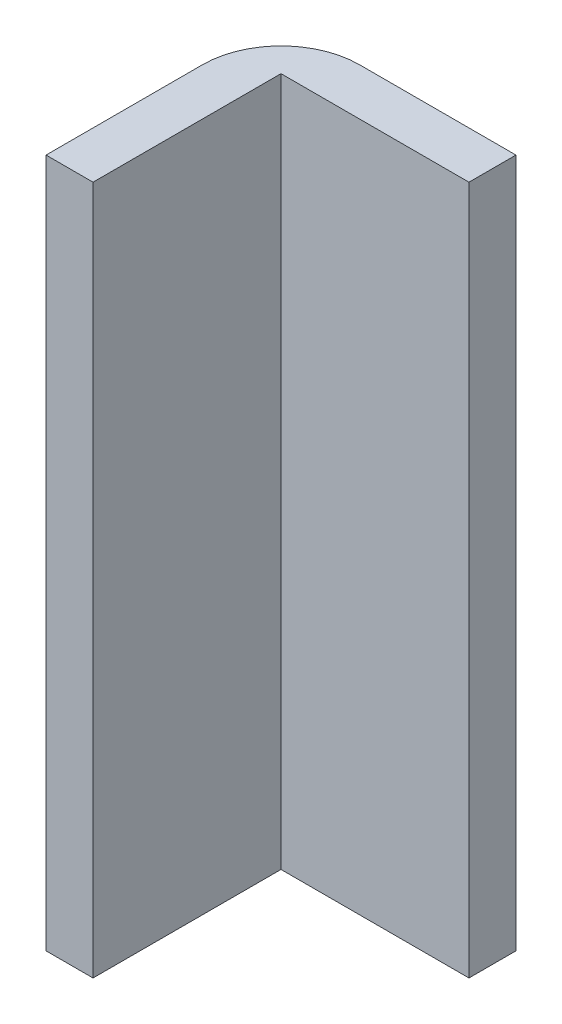
ISO-10303-21;
HEADER;
FILE_DESCRIPTION(('STEP AP214'),'2;1');
FILE_NAME('part.step','',(''),(''),'','','');
FILE_SCHEMA(('AUTOMOTIVE_DESIGN { 1 0 10303 214 1 1 1 1 }'));
ENDSEC;
DATA;
#1=APPLICATION_CONTEXT('core data for automotive mechanical design processes');
#2=APPLICATION_PROTOCOL_DEFINITION('international standard','automotive_design',2000,#1);
#3=PRODUCT_CONTEXT('',#1,'mechanical');
#4=PRODUCT('Part','Part','',(#3));
#5=PRODUCT_RELATED_PRODUCT_CATEGORY('part','',(#4));
#6=PRODUCT_DEFINITION_FORMATION('','',#4);
#7=PRODUCT_DEFINITION_CONTEXT('part definition',#1,'design');
#8=PRODUCT_DEFINITION('design','',#6,#7);
#9=PRODUCT_DEFINITION_SHAPE('','',#8);
#10=(LENGTH_UNIT() NAMED_UNIT(*) SI_UNIT(.MILLI.,.METRE.));
#11=(NAMED_UNIT(*) PLANE_ANGLE_UNIT() SI_UNIT($,.RADIAN.));
#12=(NAMED_UNIT(*) SI_UNIT($,.STERADIAN.) SOLID_ANGLE_UNIT());
#13=UNCERTAINTY_MEASURE_WITH_UNIT(LENGTH_MEASURE(1.E-05),#10,'distance_accuracy_value','');
#14=(GEOMETRIC_REPRESENTATION_CONTEXT(3) GLOBAL_UNCERTAINTY_ASSIGNED_CONTEXT((#13)) GLOBAL_UNIT_ASSIGNED_CONTEXT((#10,
#11,#12)) REPRESENTATION_CONTEXT('',''));
#15=CARTESIAN_POINT('',(0.,0.,0.));
#16=DIRECTION('',(0.,0.,1.));
#17=DIRECTION('',(1.,0.,0.));
#18=AXIS2_PLACEMENT_3D('',#15,#16,#17);
#19=CARTESIAN_POINT('',(-98.3544303797468,-0.0100000000000031,-32.8481012658228));
#20=DIRECTION('',(0.,0.,-1.));
#21=DIRECTION('',(-1.,0.,0.));
#22=AXIS2_PLACEMENT_3D('',#19,#20,#21);
#23=PLANE('',#22);
#24=DIRECTION('',(1.,0.,0.));
#25=VECTOR('',#24,1.);
#26=CARTESIAN_POINT('',(0.,3.,-32.8481012658228));
#27=LINE('',#26,#25);
#28=CARTESIAN_POINT('',(-98.3544303797468,3.,-32.8481012658228));
#29=VERTEX_POINT('',#28);
#30=CARTESIAN_POINT('',(-95.3544303797468,3.,-32.8481012658228));
#31=VERTEX_POINT('',#30);
#32=EDGE_CURVE('E102',#29,#31,#27,.T.);
#33=ORIENTED_EDGE('',*,*,#32,.T.);
#34=DIRECTION('',(0.,1.,0.));
#35=VECTOR('',#34,1.);
#36=CARTESIAN_POINT('',(-95.3544303797468,47.,-32.8481012658228));
#37=LINE('',#36,#35);
#38=CARTESIAN_POINT('',(-95.3544303797468,47.,-32.8481012658228));
#39=VERTEX_POINT('',#38);
#40=EDGE_CURVE('E36',#31,#39,#37,.T.);
#41=ORIENTED_EDGE('',*,*,#40,.T.);
#42=DIRECTION('',(-1.,0.,0.));
#43=VECTOR('',#42,1.);
#44=CARTESIAN_POINT('',(0.,47.,-32.8481012658228));
#45=LINE('',#44,#43);
#46=CARTESIAN_POINT('',(-98.3544303797468,47.,-32.8481012658228));
#47=VERTEX_POINT('',#46);
#48=EDGE_CURVE('E157',#39,#47,#45,.T.);
#49=ORIENTED_EDGE('',*,*,#48,.T.);
#50=DIRECTION('',(0.,1.,0.));
#51=VECTOR('',#50,1.);
#52=CARTESIAN_POINT('',(-98.3544303797468,50.,-32.8481012658228));
#53=LINE('',#52,#51);
#54=EDGE_CURVE('E103',#29,#47,#53,.T.);
#55=ORIENTED_EDGE('',*,*,#54,.F.);
#56=EDGE_LOOP('',(#33,#41,#49,#55));
#57=FACE_BOUND('',#56,.T.);
#58=ADVANCED_FACE('F32',(#57),#23,.F.);
#59=CARTESIAN_POINT('',(-83.3544303797469,-0.0100000000000031,-44.8481012658228));
#60=DIRECTION('',(-1.,0.,0.));
#61=DIRECTION('',(0.,0.,1.));
#62=AXIS2_PLACEMENT_3D('',#59,#60,#61);
#63=PLANE('',#62);
#64=DIRECTION('',(0.,0.,-1.));
#65=VECTOR('',#64,1.);
#66=CARTESIAN_POINT('',(-83.3544303797469,3.,0.));
#67=LINE('',#66,#65);
#68=CARTESIAN_POINT('',(-83.3544303797469,3.,-44.8481012658228));
#69=VERTEX_POINT('',#68);
#70=CARTESIAN_POINT('',(-83.3544303797469,3.,-47.8481012658228));
#71=VERTEX_POINT('',#70);
#72=EDGE_CURVE('E101',#69,#71,#67,.T.);
#73=ORIENTED_EDGE('',*,*,#72,.T.);
#74=DIRECTION('',(0.,-1.,0.));
#75=VECTOR('',#74,1.);
#76=CARTESIAN_POINT('',(-83.3544303797469,50.,-47.8481012658228));
#77=LINE('',#76,#75);
#78=CARTESIAN_POINT('',(-83.3544303797469,47.,-47.8481012658228));
#79=VERTEX_POINT('',#78);
#80=EDGE_CURVE('E149',#79,#71,#77,.T.);
#81=ORIENTED_EDGE('',*,*,#80,.F.);
#82=DIRECTION('',(0.,0.,1.));
#83=VECTOR('',#82,1.);
#84=CARTESIAN_POINT('',(-83.3544303797469,47.,0.));
#85=LINE('',#84,#83);
#86=CARTESIAN_POINT('',(-83.3544303797469,47.,-44.8481012658228));
#87=VERTEX_POINT('',#86);
#88=EDGE_CURVE('E104',#79,#87,#85,.T.);
#89=ORIENTED_EDGE('',*,*,#88,.T.);
#90=DIRECTION('',(0.,1.,0.));
#91=VECTOR('',#90,1.);
#92=CARTESIAN_POINT('',(-83.3544303797469,-0.0100000000000031,-44.8481012658228));
#93=LINE('',#92,#91);
#94=EDGE_CURVE('E140',#69,#87,#93,.T.);
#95=ORIENTED_EDGE('',*,*,#94,.F.);
#96=EDGE_LOOP('',(#73,#81,#89,#95));
#97=FACE_BOUND('',#96,.T.);
#98=ADVANCED_FACE('F118',(#97),#63,.F.);
#99=CARTESIAN_POINT('',(-95.3544303797468,47.,-47.8481012658228));
#100=DIRECTION('',(1.,0.,0.));
#101=DIRECTION('',(0.,0.,-1.));
#102=AXIS2_PLACEMENT_3D('',#99,#100,#101);
#103=PLANE('',#102);
#104=ORIENTED_EDGE('',*,*,#40,.F.);
#105=DIRECTION('',(0.,0.,1.));
#106=VECTOR('',#105,1.);
#107=CARTESIAN_POINT('',(-95.3544303797468,3.,-47.8481012658228));
#108=LINE('',#107,#106);
#109=CARTESIAN_POINT('',(-95.3544303797468,3.,-44.8481012658228));
#110=VERTEX_POINT('',#109);
#111=EDGE_CURVE('E11',#110,#31,#108,.T.);
#112=ORIENTED_EDGE('',*,*,#111,.F.);
#113=DIRECTION('',(0.,-1.,0.));
#114=VECTOR('',#113,1.);
#115=CARTESIAN_POINT('',(-95.3544303797468,47.,-44.8481012658228));
#116=LINE('',#115,#114);
#117=CARTESIAN_POINT('',(-95.3544303797468,47.,-44.8481012658228));
#118=VERTEX_POINT('',#117);
#119=EDGE_CURVE('E142',#118,#110,#116,.T.);
#120=ORIENTED_EDGE('',*,*,#119,.F.);
#121=DIRECTION('',(0.,0.,1.));
#122=VECTOR('',#121,1.);
#123=CARTESIAN_POINT('',(-95.3544303797468,47.,-47.8481012658228));
#124=LINE('',#123,#122);
#125=EDGE_CURVE('E98',#118,#39,#124,.T.);
#126=ORIENTED_EDGE('',*,*,#125,.T.);
#127=EDGE_LOOP('',(#104,#112,#120,#126));
#128=FACE_BOUND('',#127,.T.);
#129=ADVANCED_FACE('F95',(#128),#103,.T.);
#130=CARTESIAN_POINT('',(-93.3544303797468,50.,-42.8481012658228));
#131=DIRECTION('',(0.,-1.,0.));
#132=DIRECTION('',(0.,0.,-1.));
#133=AXIS2_PLACEMENT_3D('',#130,#131,#132);
#134=CYLINDRICAL_SURFACE('',#133,5.);
#135=DIRECTION('',(0.,-1.,0.));
#136=VECTOR('',#135,1.);
#137=CARTESIAN_POINT('',(-98.3544303797468,50.,-42.8481012658228));
#138=LINE('',#137,#136);
#139=CARTESIAN_POINT('',(-98.3544303797468,47.,-42.8481012658228));
#140=VERTEX_POINT('',#139);
#141=CARTESIAN_POINT('',(-98.3544303797468,3.,-42.8481012658228));
#142=VERTEX_POINT('',#141);
#143=EDGE_CURVE('E166',#140,#142,#138,.T.);
#144=ORIENTED_EDGE('',*,*,#143,.F.);
#145=CARTESIAN_POINT('',(-93.3544303797468,47.,-42.8481012658228));
#146=DIRECTION('',(0.,1.,0.));
#147=DIRECTION('',(0.,0.,1.));
#148=AXIS2_PLACEMENT_3D('',#145,#146,#147);
#149=CIRCLE('',#148,5.);
#150=CARTESIAN_POINT('',(-93.3544303797468,47.,-47.8481012658228));
#151=VERTEX_POINT('',#150);
#152=EDGE_CURVE('E168',#140,#151,#149,.F.);
#153=ORIENTED_EDGE('',*,*,#152,.T.);
#154=DIRECTION('',(0.,-1.,0.));
#155=VECTOR('',#154,1.);
#156=CARTESIAN_POINT('',(-93.3544303797468,50.,-47.8481012658228));
#157=LINE('',#156,#155);
#158=CARTESIAN_POINT('',(-93.3544303797468,3.,-47.8481012658228));
#159=VERTEX_POINT('',#158);
#160=EDGE_CURVE('E169',#159,#151,#157,.F.);
#161=ORIENTED_EDGE('',*,*,#160,.F.);
#162=CARTESIAN_POINT('',(-93.3544303797468,3.,-42.8481012658228));
#163=DIRECTION('',(0.,-1.,0.));
#164=DIRECTION('',(0.,0.,-1.));
#165=AXIS2_PLACEMENT_3D('',#162,#163,#164);
#166=CIRCLE('',#165,5.);
#167=EDGE_CURVE('E167',#159,#142,#166,.F.);
#168=ORIENTED_EDGE('',*,*,#167,.T.);
#169=EDGE_LOOP('',(#144,#153,#161,#168));
#170=FACE_BOUND('',#169,.T.);
#171=ADVANCED_FACE('F107',(#170),#134,.T.);
#172=CARTESIAN_POINT('',(0.,3.,0.));
#173=DIRECTION('',(0.,-1.,0.));
#174=DIRECTION('',(0.,0.,-1.));
#175=AXIS2_PLACEMENT_3D('',#172,#173,#174);
#176=PLANE('',#175);
#177=ORIENTED_EDGE('',*,*,#32,.F.);
#178=DIRECTION('',(0.,0.,-1.));
#179=VECTOR('',#178,1.);
#180=CARTESIAN_POINT('',(-98.3544303797468,3.,-47.8481012658228));
#181=LINE('',#180,#179);
#182=EDGE_CURVE('E54',#29,#142,#181,.T.);
#183=ORIENTED_EDGE('',*,*,#182,.T.);
#184=ORIENTED_EDGE('',*,*,#167,.F.);
#185=DIRECTION('',(1.,0.,0.));
#186=VECTOR('',#185,1.);
#187=CARTESIAN_POINT('',(-98.3544303797468,3.,-47.8481012658228));
#188=LINE('',#187,#186);
#189=EDGE_CURVE('E143',#159,#71,#188,.T.);
#190=ORIENTED_EDGE('',*,*,#189,.T.);
#191=ORIENTED_EDGE('',*,*,#72,.F.);
#192=DIRECTION('',(-1.,0.,0.));
#193=VECTOR('',#192,1.);
#194=CARTESIAN_POINT('',(-98.3544303797468,3.,-44.8481012658228));
#195=LINE('',#194,#193);
#196=EDGE_CURVE('E41',#69,#110,#195,.T.);
#197=ORIENTED_EDGE('',*,*,#196,.T.);
#198=ORIENTED_EDGE('',*,*,#111,.T.);
#199=EDGE_LOOP('',(#177,#183,#184,#190,#191,#197,#198));
#200=FACE_BOUND('',#199,.T.);
#201=ADVANCED_FACE('F105',(#200),#176,.T.);
#202=CARTESIAN_POINT('',(0.,47.,0.));
#203=DIRECTION('',(0.,1.,0.));
#204=DIRECTION('',(0.,0.,1.));
#205=AXIS2_PLACEMENT_3D('',#202,#203,#204);
#206=PLANE('',#205);
#207=ORIENTED_EDGE('',*,*,#48,.F.);
#208=ORIENTED_EDGE('',*,*,#125,.F.);
#209=DIRECTION('',(-1.,0.,0.));
#210=VECTOR('',#209,1.);
#211=CARTESIAN_POINT('',(-98.3544303797468,47.,-44.8481012658228));
#212=LINE('',#211,#210);
#213=EDGE_CURVE('E153',#87,#118,#212,.T.);
#214=ORIENTED_EDGE('',*,*,#213,.F.);
#215=ORIENTED_EDGE('',*,*,#88,.F.);
#216=DIRECTION('',(-1.,0.,0.));
#217=VECTOR('',#216,1.);
#218=CARTESIAN_POINT('',(-98.3544303797468,47.,-47.8481012658228));
#219=LINE('',#218,#217);
#220=EDGE_CURVE('E146',#79,#151,#219,.T.);
#221=ORIENTED_EDGE('',*,*,#220,.T.);
#222=ORIENTED_EDGE('',*,*,#152,.F.);
#223=DIRECTION('',(0.,0.,1.));
#224=VECTOR('',#223,1.);
#225=CARTESIAN_POINT('',(-98.3544303797468,47.,-47.8481012658228));
#226=LINE('',#225,#224);
#227=EDGE_CURVE('E156',#140,#47,#226,.T.);
#228=ORIENTED_EDGE('',*,*,#227,.T.);
#229=EDGE_LOOP('',(#207,#208,#214,#215,#221,#222,#228));
#230=FACE_BOUND('',#229,.T.);
#231=ADVANCED_FACE('F34',(#230),#206,.T.);
#232=CARTESIAN_POINT('',(-98.3544303797468,50.,-47.8481012658228));
#233=DIRECTION('',(0.,0.,1.));
#234=DIRECTION('',(1.,0.,0.));
#235=AXIS2_PLACEMENT_3D('',#232,#233,#234);
#236=PLANE('',#235);
#237=ORIENTED_EDGE('',*,*,#220,.F.);
#238=ORIENTED_EDGE('',*,*,#80,.T.);
#239=ORIENTED_EDGE('',*,*,#189,.F.);
#240=ORIENTED_EDGE('',*,*,#160,.T.);
#241=EDGE_LOOP('',(#237,#238,#239,#240));
#242=FACE_BOUND('',#241,.T.);
#243=ADVANCED_FACE('F112',(#242),#236,.F.);
#244=CARTESIAN_POINT('',(-98.3544303797468,50.,-47.8481012658228));
#245=DIRECTION('',(1.,0.,0.));
#246=DIRECTION('',(0.,0.,-1.));
#247=AXIS2_PLACEMENT_3D('',#244,#245,#246);
#248=PLANE('',#247);
#249=ORIENTED_EDGE('',*,*,#182,.F.);
#250=ORIENTED_EDGE('',*,*,#54,.T.);
#251=ORIENTED_EDGE('',*,*,#227,.F.);
#252=ORIENTED_EDGE('',*,*,#143,.T.);
#253=EDGE_LOOP('',(#249,#250,#251,#252));
#254=FACE_BOUND('',#253,.T.);
#255=ADVANCED_FACE('F128',(#254),#248,.F.);
#256=CARTESIAN_POINT('',(-98.3544303797468,47.,-44.8481012658228));
#257=DIRECTION('',(0.,0.,1.));
#258=DIRECTION('',(1.,0.,0.));
#259=AXIS2_PLACEMENT_3D('',#256,#257,#258);
#260=PLANE('',#259);
#261=ORIENTED_EDGE('',*,*,#196,.F.);
#262=ORIENTED_EDGE('',*,*,#94,.T.);
#263=ORIENTED_EDGE('',*,*,#213,.T.);
#264=ORIENTED_EDGE('',*,*,#119,.T.);
#265=EDGE_LOOP('',(#261,#262,#263,#264));
#266=FACE_BOUND('',#265,.T.);
#267=ADVANCED_FACE('F126',(#266),#260,.T.);
#268=CLOSED_SHELL('',(#58,#98,#129,#171,#201,#231,#243,#255,#267));
#269=MANIFOLD_SOLID_BREP('B2',#268);
#270=ADVANCED_BREP_SHAPE_REPRESENTATION('',(#18,#269),#14);
#271=SHAPE_DEFINITION_REPRESENTATION(#9,#270);
ENDSEC;
END-ISO-10303-21;
